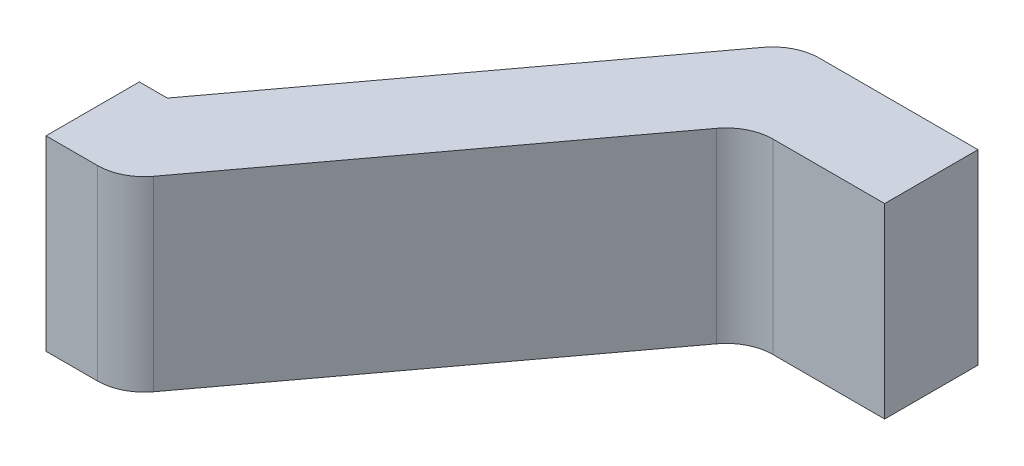
ISO-10303-21;
HEADER;
FILE_DESCRIPTION(('STEP AP214'),'2;1');
FILE_NAME('part.step','',(''),(''),'','','');
FILE_SCHEMA(('AUTOMOTIVE_DESIGN { 1 0 10303 214 1 1 1 1 }'));
ENDSEC;
DATA;
#1=APPLICATION_CONTEXT('core data for automotive mechanical design processes');
#2=APPLICATION_PROTOCOL_DEFINITION('international standard','automotive_design',2000,#1);
#3=PRODUCT_CONTEXT('',#1,'mechanical');
#4=PRODUCT('Part','Part','',(#3));
#5=PRODUCT_RELATED_PRODUCT_CATEGORY('part','',(#4));
#6=PRODUCT_DEFINITION_FORMATION('','',#4);
#7=PRODUCT_DEFINITION_CONTEXT('part definition',#1,'design');
#8=PRODUCT_DEFINITION('design','',#6,#7);
#9=PRODUCT_DEFINITION_SHAPE('','',#8);
#10=(LENGTH_UNIT() NAMED_UNIT(*) SI_UNIT(.MILLI.,.METRE.));
#11=(NAMED_UNIT(*) PLANE_ANGLE_UNIT() SI_UNIT($,.RADIAN.));
#12=(NAMED_UNIT(*) SI_UNIT($,.STERADIAN.) SOLID_ANGLE_UNIT());
#13=UNCERTAINTY_MEASURE_WITH_UNIT(LENGTH_MEASURE(1.E-05),#10,'distance_accuracy_value','');
#14=(GEOMETRIC_REPRESENTATION_CONTEXT(3) GLOBAL_UNCERTAINTY_ASSIGNED_CONTEXT((#13)) GLOBAL_UNIT_ASSIGNED_CONTEXT((#10,
#11,#12)) REPRESENTATION_CONTEXT('',''));
#15=CARTESIAN_POINT('',(0.,0.,0.));
#16=DIRECTION('',(0.,0.,1.));
#17=DIRECTION('',(1.,0.,0.));
#18=AXIS2_PLACEMENT_3D('',#15,#16,#17);
#19=CARTESIAN_POINT('',(2.6,-0.84,0.205));
#20=DIRECTION('',(0.,0.,1.));
#21=DIRECTION('',(1.,0.,0.));
#22=AXIS2_PLACEMENT_3D('',#19,#20,#21);
#23=PLANE('',#22);
#24=DIRECTION('',(1.,0.,0.));
#25=VECTOR('',#24,1.);
#26=CARTESIAN_POINT('',(2.6,-0.43,0.205));
#27=LINE('',#26,#25);
#28=CARTESIAN_POINT('',(2.754632601552,-0.43,0.205));
#29=VERTEX_POINT('',#28);
#30=CARTESIAN_POINT('',(3.,-0.43,0.205));
#31=VERTEX_POINT('',#30);
#32=EDGE_CURVE('E11',#29,#31,#27,.T.);
#33=ORIENTED_EDGE('',*,*,#32,.F.);
#34=DIRECTION('',(0.,1.,0.));
#35=VECTOR('',#34,1.);
#36=CARTESIAN_POINT('',(2.754632601552,-0.84,0.205));
#37=LINE('',#36,#35);
#38=CARTESIAN_POINT('',(2.754632601552,-0.84,0.205));
#39=VERTEX_POINT('',#38);
#40=EDGE_CURVE('E24',#39,#29,#37,.T.);
#41=ORIENTED_EDGE('',*,*,#40,.F.);
#42=DIRECTION('',(1.,0.,0.));
#43=VECTOR('',#42,1.);
#44=CARTESIAN_POINT('',(2.6,-0.84,0.205));
#45=LINE('',#44,#43);
#46=CARTESIAN_POINT('',(3.,-0.84,0.205));
#47=VERTEX_POINT('',#46);
#48=EDGE_CURVE('E172',#39,#47,#45,.T.);
#49=ORIENTED_EDGE('',*,*,#48,.T.);
#50=DIRECTION('',(0.,1.,0.));
#51=VECTOR('',#50,1.);
#52=CARTESIAN_POINT('',(3.,-0.84,0.205));
#53=LINE('',#52,#51);
#54=EDGE_CURVE('E170',#47,#31,#53,.T.);
#55=ORIENTED_EDGE('',*,*,#54,.T.);
#56=EDGE_LOOP('',(#33,#41,#49,#55));
#57=FACE_BOUND('',#56,.T.);
#58=ADVANCED_FACE('F17',(#57),#23,.T.);
#59=CARTESIAN_POINT('',(2.6,-0.43,0.));
#60=DIRECTION('',(0.,1.,0.));
#61=DIRECTION('',(0.,0.,1.));
#62=AXIS2_PLACEMENT_3D('',#59,#60,#61);
#63=PLANE('',#62);
#64=DIRECTION('',(1.,0.,0.));
#65=VECTOR('',#64,1.);
#66=CARTESIAN_POINT('',(2.6,-0.43,0.));
#67=LINE('',#66,#65);
#68=CARTESIAN_POINT('',(2.651544200517,-0.43,0.));
#69=VERTEX_POINT('',#68);
#70=CARTESIAN_POINT('',(3.,-0.43,0.));
#71=VERTEX_POINT('',#70);
#72=EDGE_CURVE('E168',#69,#71,#67,.T.);
#73=ORIENTED_EDGE('',*,*,#72,.F.);
#74=CARTESIAN_POINT('',(2.651544200517,-0.43,0.1025));
#75=DIRECTION('',(0.,1.,0.));
#76=DIRECTION('',(0.,0.,1.));
#77=AXIS2_PLACEMENT_3D('',#74,#75,#76);
#78=CIRCLE('',#77,0.1025);
#79=CARTESIAN_POINT('',(2.569262956102,-0.43,0.0413767898629));
#80=VERTEX_POINT('',#79);
#81=EDGE_CURVE('E118',#69,#80,#78,.T.);
#82=ORIENTED_EDGE('',*,*,#81,.T.);
#83=DIRECTION('',(-0.596324001338072,0.,0.802743847954097));
#84=VECTOR('',#83,1.);
#85=CARTESIAN_POINT('',(2.6,-0.43,0.));
#86=LINE('',#85,#84);
#87=CARTESIAN_POINT('',(2.011474087796,-0.43,0.792246420274));
#88=VERTEX_POINT('',#87);
#89=EDGE_CURVE('E165',#80,#88,#86,.T.);
#90=ORIENTED_EDGE('',*,*,#89,.T.);
#91=DIRECTION('',(1.,0.,0.));
#92=VECTOR('',#91,1.);
#93=CARTESIAN_POINT('',(1.95,-0.43,0.792246420274));
#94=LINE('',#93,#92);
#95=CARTESIAN_POINT('',(1.95,-0.43,0.792246420274));
#96=VERTEX_POINT('',#95);
#97=EDGE_CURVE('E162',#96,#88,#94,.T.);
#98=ORIENTED_EDGE('',*,*,#97,.F.);
#99=DIRECTION('',(0.,0.,1.));
#100=VECTOR('',#99,1.);
#101=CARTESIAN_POINT('',(1.95,-0.43,0.792246420274));
#102=LINE('',#101,#100);
#103=CARTESIAN_POINT('',(1.95,-0.43,0.997246420274));
#104=VERTEX_POINT('',#103);
#105=EDGE_CURVE('E160',#96,#104,#102,.T.);
#106=ORIENTED_EDGE('',*,*,#105,.T.);
#107=DIRECTION('',(1.,0.,0.));
#108=VECTOR('',#107,1.);
#109=CARTESIAN_POINT('',(1.95,-0.43,0.997246420274));
#110=LINE('',#109,#108);
#111=CARTESIAN_POINT('',(2.063018288313,-0.43,0.997246420274));
#112=VERTEX_POINT('',#111);
#113=EDGE_CURVE('E158',#104,#112,#110,.T.);
#114=ORIENTED_EDGE('',*,*,#113,.T.);
#115=CARTESIAN_POINT('',(2.063018288313,-0.43,0.894746420274));
#116=DIRECTION('',(0.,-1.,0.));
#117=DIRECTION('',(0.,0.,1.));
#118=AXIS2_PLACEMENT_3D('',#115,#116,#117);
#119=CIRCLE('',#118,0.1025);
#120=CARTESIAN_POINT('',(2.145299532729,-0.43,0.955869630411));
#121=VERTEX_POINT('',#120);
#122=EDGE_CURVE('E155',#121,#112,#119,.T.);
#123=ORIENTED_EDGE('',*,*,#122,.F.);
#124=DIRECTION('',(-0.596324001338072,0.,0.802743847954097));
#125=VECTOR('',#124,1.);
#126=CARTESIAN_POINT('',(2.764562488831,-0.43,0.122246420274));
#127=LINE('',#126,#125);
#128=CARTESIAN_POINT('',(2.672351357136,-0.43,0.246376789863));
#129=VERTEX_POINT('',#128);
#130=EDGE_CURVE('E152',#129,#121,#127,.T.);
#131=ORIENTED_EDGE('',*,*,#130,.F.);
#132=CARTESIAN_POINT('',(2.754632601552,-0.43,0.3075));
#133=DIRECTION('',(0.,1.,0.));
#134=DIRECTION('',(0.,0.,1.));
#135=AXIS2_PLACEMENT_3D('',#132,#133,#134);
#136=CIRCLE('',#135,0.1025);
#137=EDGE_CURVE('E149',#29,#129,#136,.T.);
#138=ORIENTED_EDGE('',*,*,#137,.F.);
#139=ORIENTED_EDGE('',*,*,#32,.T.);
#140=DIRECTION('',(0.,0.,1.));
#141=VECTOR('',#140,1.);
#142=CARTESIAN_POINT('',(3.,-0.43,0.));
#143=LINE('',#142,#141);
#144=EDGE_CURVE('E146',#71,#31,#143,.T.);
#145=ORIENTED_EDGE('',*,*,#144,.F.);
#146=EDGE_LOOP('',(#73,#82,#90,#98,#106,#114,#123,#131,#138,#139,#145));
#147=FACE_BOUND('',#146,.T.);
#148=ADVANCED_FACE('F178',(#147),#63,.T.);
#149=CARTESIAN_POINT('',(2.754632601552,-0.84,0.3075));
#150=DIRECTION('',(0.,1.,0.));
#151=DIRECTION('',(0.,0.,-1.));
#152=AXIS2_PLACEMENT_3D('',#149,#150,#151);
#153=CYLINDRICAL_SURFACE('',#152,0.1025);
#154=ORIENTED_EDGE('',*,*,#40,.T.);
#155=ORIENTED_EDGE('',*,*,#137,.T.);
#156=DIRECTION('',(0.,1.,0.));
#157=VECTOR('',#156,1.);
#158=CARTESIAN_POINT('',(2.672351357136,-0.84,0.246376789863));
#159=LINE('',#158,#157);
#160=CARTESIAN_POINT('',(2.672351357136,-0.84,0.246376789863));
#161=VERTEX_POINT('',#160);
#162=EDGE_CURVE('E143',#161,#129,#159,.T.);
#163=ORIENTED_EDGE('',*,*,#162,.F.);
#164=CARTESIAN_POINT('',(2.754632601552,-0.84,0.3075));
#165=DIRECTION('',(0.,1.,0.));
#166=DIRECTION('',(0.,0.,1.));
#167=AXIS2_PLACEMENT_3D('',#164,#165,#166);
#168=CIRCLE('',#167,0.1025);
#169=EDGE_CURVE('E141',#39,#161,#168,.T.);
#170=ORIENTED_EDGE('',*,*,#169,.F.);
#171=EDGE_LOOP('',(#154,#155,#163,#170));
#172=FACE_BOUND('',#171,.T.);
#173=ADVANCED_FACE('F175',(#172),#153,.F.);
#174=CARTESIAN_POINT('',(3.,-0.84,0.));
#175=DIRECTION('',(1.,0.,0.));
#176=DIRECTION('',(0.,0.,1.));
#177=AXIS2_PLACEMENT_3D('',#174,#175,#176);
#178=PLANE('',#177);
#179=DIRECTION('',(0.,0.,1.));
#180=VECTOR('',#179,1.);
#181=CARTESIAN_POINT('',(3.,-0.84,0.));
#182=LINE('',#181,#180);
#183=CARTESIAN_POINT('',(3.,-0.84,0.));
#184=VERTEX_POINT('',#183);
#185=EDGE_CURVE('E139',#184,#47,#182,.T.);
#186=ORIENTED_EDGE('',*,*,#185,.F.);
#187=DIRECTION('',(0.,1.,0.));
#188=VECTOR('',#187,1.);
#189=CARTESIAN_POINT('',(3.,-0.84,0.));
#190=LINE('',#189,#188);
#191=EDGE_CURVE('E103',#184,#71,#190,.T.);
#192=ORIENTED_EDGE('',*,*,#191,.T.);
#193=ORIENTED_EDGE('',*,*,#144,.T.);
#194=ORIENTED_EDGE('',*,*,#54,.F.);
#195=EDGE_LOOP('',(#186,#192,#193,#194));
#196=FACE_BOUND('',#195,.T.);
#197=ADVANCED_FACE('F217',(#196),#178,.T.);
#198=CARTESIAN_POINT('',(2.6,-0.84,0.));
#199=DIRECTION('',(0.,1.,0.));
#200=DIRECTION('',(0.,0.,1.));
#201=AXIS2_PLACEMENT_3D('',#198,#199,#200);
#202=PLANE('',#201);
#203=ORIENTED_EDGE('',*,*,#185,.T.);
#204=ORIENTED_EDGE('',*,*,#48,.F.);
#205=ORIENTED_EDGE('',*,*,#169,.T.);
#206=DIRECTION('',(-0.596324001338072,0.,0.802743847954097));
#207=VECTOR('',#206,1.);
#208=CARTESIAN_POINT('',(2.764562488831,-0.84,0.122246420274));
#209=LINE('',#208,#207);
#210=CARTESIAN_POINT('',(2.145299532729,-0.84,0.955869630411));
#211=VERTEX_POINT('',#210);
#212=EDGE_CURVE('E135',#161,#211,#209,.T.);
#213=ORIENTED_EDGE('',*,*,#212,.T.);
#214=CARTESIAN_POINT('',(2.063018288313,-0.84,0.894746420274));
#215=DIRECTION('',(0.,-1.,0.));
#216=DIRECTION('',(0.,0.,1.));
#217=AXIS2_PLACEMENT_3D('',#214,#215,#216);
#218=CIRCLE('',#217,0.1025);
#219=CARTESIAN_POINT('',(2.063018288313,-0.84,0.997246420274));
#220=VERTEX_POINT('',#219);
#221=EDGE_CURVE('E132',#211,#220,#218,.T.);
#222=ORIENTED_EDGE('',*,*,#221,.T.);
#223=DIRECTION('',(1.,0.,0.));
#224=VECTOR('',#223,1.);
#225=CARTESIAN_POINT('',(1.95,-0.84,0.997246420274));
#226=LINE('',#225,#224);
#227=CARTESIAN_POINT('',(1.95,-0.84,0.997246420274));
#228=VERTEX_POINT('',#227);
#229=EDGE_CURVE('E130',#228,#220,#226,.T.);
#230=ORIENTED_EDGE('',*,*,#229,.F.);
#231=DIRECTION('',(0.,0.,1.));
#232=VECTOR('',#231,1.);
#233=CARTESIAN_POINT('',(1.95,-0.84,0.792246420274));
#234=LINE('',#233,#232);
#235=CARTESIAN_POINT('',(1.95,-0.84,0.792246420274));
#236=VERTEX_POINT('',#235);
#237=EDGE_CURVE('E128',#236,#228,#234,.T.);
#238=ORIENTED_EDGE('',*,*,#237,.F.);
#239=DIRECTION('',(1.,0.,0.));
#240=VECTOR('',#239,1.);
#241=CARTESIAN_POINT('',(1.95,-0.84,0.792246420274));
#242=LINE('',#241,#240);
#243=CARTESIAN_POINT('',(2.011474087796,-0.84,0.792246420274));
#244=VERTEX_POINT('',#243);
#245=EDGE_CURVE('E126',#236,#244,#242,.T.);
#246=ORIENTED_EDGE('',*,*,#245,.T.);
#247=DIRECTION('',(-0.596324001338072,0.,0.802743847954097));
#248=VECTOR('',#247,1.);
#249=CARTESIAN_POINT('',(2.6,-0.84,0.));
#250=LINE('',#249,#248);
#251=CARTESIAN_POINT('',(2.569262956102,-0.84,0.0413767898629));
#252=VERTEX_POINT('',#251);
#253=EDGE_CURVE('E111',#252,#244,#250,.T.);
#254=ORIENTED_EDGE('',*,*,#253,.F.);
#255=CARTESIAN_POINT('',(2.651544200517,-0.84,0.1025));
#256=DIRECTION('',(0.,1.,0.));
#257=DIRECTION('',(0.,0.,1.));
#258=AXIS2_PLACEMENT_3D('',#255,#256,#257);
#259=CIRCLE('',#258,0.1025);
#260=CARTESIAN_POINT('',(2.651544200517,-0.84,0.));
#261=VERTEX_POINT('',#260);
#262=EDGE_CURVE('E106',#261,#252,#259,.T.);
#263=ORIENTED_EDGE('',*,*,#262,.F.);
#264=DIRECTION('',(1.,0.,0.));
#265=VECTOR('',#264,1.);
#266=CARTESIAN_POINT('',(2.6,-0.84,0.));
#267=LINE('',#266,#265);
#268=EDGE_CURVE('E97',#261,#184,#267,.T.);
#269=ORIENTED_EDGE('',*,*,#268,.T.);
#270=EDGE_LOOP('',(#203,#204,#205,#213,#222,#230,#238,#246,#254,#263,#269));
#271=FACE_BOUND('',#270,.T.);
#272=ADVANCED_FACE('F109',(#271),#202,.F.);
#273=CARTESIAN_POINT('',(2.6,-0.84,0.));
#274=DIRECTION('',(0.,0.,1.));
#275=DIRECTION('',(1.,0.,0.));
#276=AXIS2_PLACEMENT_3D('',#273,#274,#275);
#277=PLANE('',#276);
#278=DIRECTION('',(0.,1.,0.));
#279=VECTOR('',#278,1.);
#280=CARTESIAN_POINT('',(2.651544200517,-0.84,0.));
#281=LINE('',#280,#279);
#282=EDGE_CURVE('E101',#261,#69,#281,.T.);
#283=ORIENTED_EDGE('',*,*,#282,.T.);
#284=ORIENTED_EDGE('',*,*,#72,.T.);
#285=ORIENTED_EDGE('',*,*,#191,.F.);
#286=ORIENTED_EDGE('',*,*,#268,.F.);
#287=EDGE_LOOP('',(#283,#284,#285,#286));
#288=FACE_BOUND('',#287,.T.);
#289=ADVANCED_FACE('F99',(#288),#277,.F.);
#290=CARTESIAN_POINT('',(2.651544200517,-0.84,0.1025));
#291=DIRECTION('',(0.,1.,0.));
#292=DIRECTION('',(0.,0.,-1.));
#293=AXIS2_PLACEMENT_3D('',#290,#291,#292);
#294=CYLINDRICAL_SURFACE('',#293,0.1025);
#295=ORIENTED_EDGE('',*,*,#262,.T.);
#296=DIRECTION('',(0.,1.,0.));
#297=VECTOR('',#296,1.);
#298=CARTESIAN_POINT('',(2.569262956102,-0.84,0.0413767898629));
#299=LINE('',#298,#297);
#300=EDGE_CURVE('E119',#252,#80,#299,.T.);
#301=ORIENTED_EDGE('',*,*,#300,.T.);
#302=ORIENTED_EDGE('',*,*,#81,.F.);
#303=ORIENTED_EDGE('',*,*,#282,.F.);
#304=EDGE_LOOP('',(#295,#301,#302,#303));
#305=FACE_BOUND('',#304,.T.);
#306=ADVANCED_FACE('F117',(#305),#294,.T.);
#307=CARTESIAN_POINT('',(2.6,-0.84,0.));
#308=DIRECTION('',(0.802743847954097,0.,0.596324001338072));
#309=DIRECTION('',(-0.596324001338072,0.,0.802743847954097));
#310=AXIS2_PLACEMENT_3D('',#307,#308,#309);
#311=PLANE('',#310);
#312=DIRECTION('',(0.,1.,0.));
#313=VECTOR('',#312,1.);
#314=CARTESIAN_POINT('',(2.011474087796,-0.84,0.792246420274));
#315=LINE('',#314,#313);
#316=EDGE_CURVE('E121',#244,#88,#315,.T.);
#317=ORIENTED_EDGE('',*,*,#316,.T.);
#318=ORIENTED_EDGE('',*,*,#89,.F.);
#319=ORIENTED_EDGE('',*,*,#300,.F.);
#320=ORIENTED_EDGE('',*,*,#253,.T.);
#321=EDGE_LOOP('',(#317,#318,#319,#320));
#322=FACE_BOUND('',#321,.T.);
#323=ADVANCED_FACE('F202',(#322),#311,.F.);
#324=CARTESIAN_POINT('',(1.95,-0.84,0.792246420274));
#325=DIRECTION('',(0.,0.,1.));
#326=DIRECTION('',(1.,0.,0.));
#327=AXIS2_PLACEMENT_3D('',#324,#325,#326);
#328=PLANE('',#327);
#329=ORIENTED_EDGE('',*,*,#316,.F.);
#330=ORIENTED_EDGE('',*,*,#245,.F.);
#331=DIRECTION('',(0.,1.,0.));
#332=VECTOR('',#331,1.);
#333=CARTESIAN_POINT('',(1.95,-0.84,0.792246420274));
#334=LINE('',#333,#332);
#335=EDGE_CURVE('E193',#236,#96,#334,.T.);
#336=ORIENTED_EDGE('',*,*,#335,.T.);
#337=ORIENTED_EDGE('',*,*,#97,.T.);
#338=EDGE_LOOP('',(#329,#330,#336,#337));
#339=FACE_BOUND('',#338,.T.);
#340=ADVANCED_FACE('F204',(#339),#328,.F.);
#341=CARTESIAN_POINT('',(1.95,-0.84,0.792246420274));
#342=DIRECTION('',(1.,0.,0.));
#343=DIRECTION('',(0.,0.,1.));
#344=AXIS2_PLACEMENT_3D('',#341,#342,#343);
#345=PLANE('',#344);
#346=ORIENTED_EDGE('',*,*,#237,.T.);
#347=DIRECTION('',(0.,1.,0.));
#348=VECTOR('',#347,1.);
#349=CARTESIAN_POINT('',(1.95,-0.84,0.997246420274));
#350=LINE('',#349,#348);
#351=EDGE_CURVE('E189',#228,#104,#350,.T.);
#352=ORIENTED_EDGE('',*,*,#351,.T.);
#353=ORIENTED_EDGE('',*,*,#105,.F.);
#354=ORIENTED_EDGE('',*,*,#335,.F.);
#355=EDGE_LOOP('',(#346,#352,#353,#354));
#356=FACE_BOUND('',#355,.T.);
#357=ADVANCED_FACE('F210',(#356),#345,.F.);
#358=CARTESIAN_POINT('',(2.764562488831,-0.84,0.122246420274));
#359=DIRECTION('',(0.802743847954097,0.,0.596324001338072));
#360=DIRECTION('',(-0.596324001338072,0.,0.802743847954097));
#361=AXIS2_PLACEMENT_3D('',#358,#359,#360);
#362=PLANE('',#361);
#363=ORIENTED_EDGE('',*,*,#212,.F.);
#364=ORIENTED_EDGE('',*,*,#162,.T.);
#365=ORIENTED_EDGE('',*,*,#130,.T.);
#366=DIRECTION('',(0.,1.,0.));
#367=VECTOR('',#366,1.);
#368=CARTESIAN_POINT('',(2.145299532729,-0.84,0.955869630411));
#369=LINE('',#368,#367);
#370=EDGE_CURVE('E184',#211,#121,#369,.T.);
#371=ORIENTED_EDGE('',*,*,#370,.F.);
#372=EDGE_LOOP('',(#363,#364,#365,#371));
#373=FACE_BOUND('',#372,.T.);
#374=ADVANCED_FACE('F183',(#373),#362,.T.);
#375=CARTESIAN_POINT('',(1.95,-0.84,0.997246420274));
#376=DIRECTION('',(0.,0.,1.));
#377=DIRECTION('',(1.,0.,0.));
#378=AXIS2_PLACEMENT_3D('',#375,#376,#377);
#379=PLANE('',#378);
#380=ORIENTED_EDGE('',*,*,#113,.F.);
#381=ORIENTED_EDGE('',*,*,#351,.F.);
#382=ORIENTED_EDGE('',*,*,#229,.T.);
#383=DIRECTION('',(0.,1.,0.));
#384=VECTOR('',#383,1.);
#385=CARTESIAN_POINT('',(2.063018288313,-0.84,0.997246420274));
#386=LINE('',#385,#384);
#387=EDGE_CURVE('E190',#220,#112,#386,.T.);
#388=ORIENTED_EDGE('',*,*,#387,.T.);
#389=EDGE_LOOP('',(#380,#381,#382,#388));
#390=FACE_BOUND('',#389,.T.);
#391=ADVANCED_FACE('F214',(#390),#379,.T.);
#392=CARTESIAN_POINT('',(2.063018288313,-0.84,0.894746420274));
#393=DIRECTION('',(0.,1.,0.));
#394=DIRECTION('',(0.802743847954097,0.,0.596324001338072));
#395=AXIS2_PLACEMENT_3D('',#392,#393,#394);
#396=CYLINDRICAL_SURFACE('',#395,0.1025);
#397=ORIENTED_EDGE('',*,*,#370,.T.);
#398=ORIENTED_EDGE('',*,*,#122,.T.);
#399=ORIENTED_EDGE('',*,*,#387,.F.);
#400=ORIENTED_EDGE('',*,*,#221,.F.);
#401=EDGE_LOOP('',(#397,#398,#399,#400));
#402=FACE_BOUND('',#401,.T.);
#403=ADVANCED_FACE('F186',(#402),#396,.T.);
#404=CLOSED_SHELL('',(#58,#148,#173,#197,#272,#289,#306,#323,#340,#357,#374,#391,#403));
#405=MANIFOLD_SOLID_BREP('B1',#404);
#406=ADVANCED_BREP_SHAPE_REPRESENTATION('',(#18,#405),#14);
#407=SHAPE_DEFINITION_REPRESENTATION(#9,#406);
ENDSEC;
END-ISO-10303-21;
